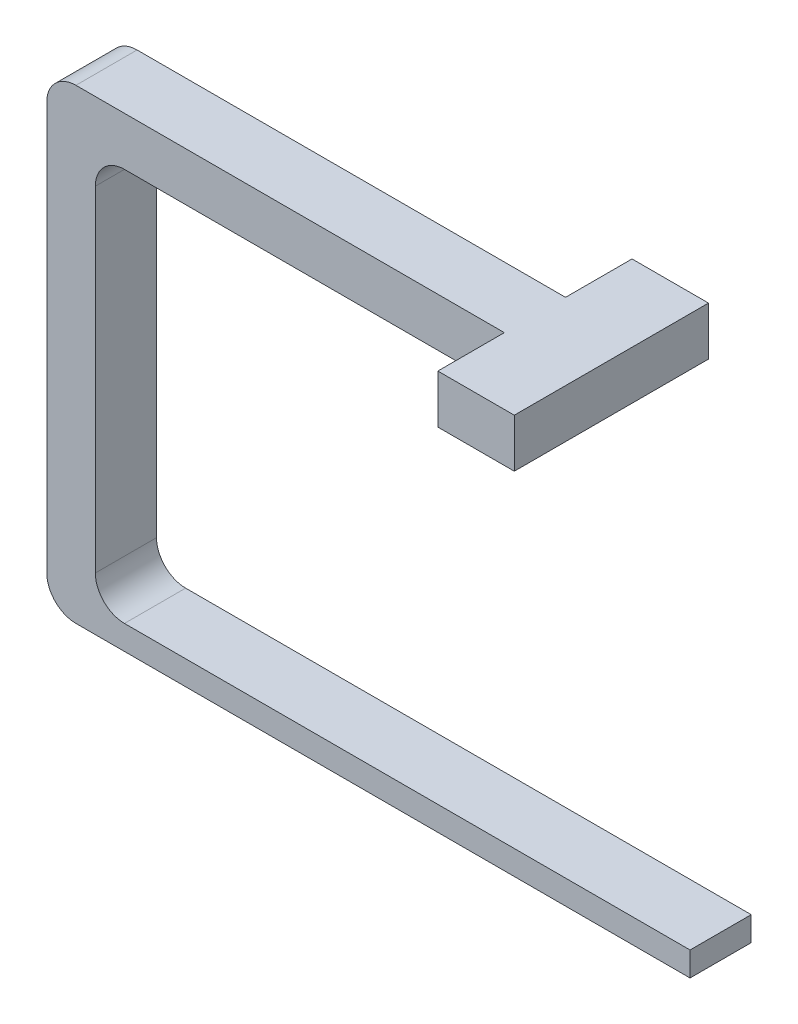
ISO-10303-21;
HEADER;
FILE_DESCRIPTION(('STEP AP214'),'2;1');
FILE_NAME('part.step','',(''),(''),'','','');
FILE_SCHEMA(('AUTOMOTIVE_DESIGN { 1 0 10303 214 1 1 1 1 }'));
ENDSEC;
DATA;
#1=APPLICATION_CONTEXT('core data for automotive mechanical design processes');
#2=APPLICATION_PROTOCOL_DEFINITION('international standard','automotive_design',2000,#1);
#3=PRODUCT_CONTEXT('',#1,'mechanical');
#4=PRODUCT('Part','Part','',(#3));
#5=PRODUCT_RELATED_PRODUCT_CATEGORY('part','',(#4));
#6=PRODUCT_DEFINITION_FORMATION('','',#4);
#7=PRODUCT_DEFINITION_CONTEXT('part definition',#1,'design');
#8=PRODUCT_DEFINITION('design','',#6,#7);
#9=PRODUCT_DEFINITION_SHAPE('','',#8);
#10=(LENGTH_UNIT() NAMED_UNIT(*) SI_UNIT(.MILLI.,.METRE.));
#11=(NAMED_UNIT(*) PLANE_ANGLE_UNIT() SI_UNIT($,.RADIAN.));
#12=(NAMED_UNIT(*) SI_UNIT($,.STERADIAN.) SOLID_ANGLE_UNIT());
#13=UNCERTAINTY_MEASURE_WITH_UNIT(LENGTH_MEASURE(1.E-05),#10,'distance_accuracy_value','');
#14=(GEOMETRIC_REPRESENTATION_CONTEXT(3) GLOBAL_UNCERTAINTY_ASSIGNED_CONTEXT((#13)) GLOBAL_UNIT_ASSIGNED_CONTEXT((#10,
#11,#12)) REPRESENTATION_CONTEXT('',''));
#15=CARTESIAN_POINT('',(0.,0.,0.));
#16=DIRECTION('',(0.,0.,1.));
#17=DIRECTION('',(1.,0.,0.));
#18=AXIS2_PLACEMENT_3D('',#15,#16,#17);
#19=CARTESIAN_POINT('',(-28.575,115.57,8.001));
#20=DIRECTION('',(-1.,0.,0.));
#21=DIRECTION('',(0.,0.,1.));
#22=AXIS2_PLACEMENT_3D('',#19,#20,#21);
#23=PLANE('',#22);
#24=DIRECTION('',(0.,0.,-1.));
#25=VECTOR('',#24,1.);
#26=CARTESIAN_POINT('',(-28.575,102.87,8.001));
#27=LINE('',#26,#25);
#28=CARTESIAN_POINT('',(-28.575,102.87,25.4));
#29=VERTEX_POINT('',#28);
#30=CARTESIAN_POINT('',(-28.575,102.87,-25.4));
#31=VERTEX_POINT('',#30);
#32=EDGE_CURVE('E209',#29,#31,#27,.T.);
#33=ORIENTED_EDGE('',*,*,#32,.T.);
#34=DIRECTION('',(0.,-1.,0.));
#35=VECTOR('',#34,1.);
#36=CARTESIAN_POINT('',(-28.575,170.165237887567,-25.4));
#37=LINE('',#36,#35);
#38=CARTESIAN_POINT('',(-28.575,115.57,-25.4));
#39=VERTEX_POINT('',#38);
#40=EDGE_CURVE('E168',#39,#31,#37,.T.);
#41=ORIENTED_EDGE('',*,*,#40,.F.);
#42=DIRECTION('',(0.,0.,-1.));
#43=VECTOR('',#42,1.);
#44=CARTESIAN_POINT('',(-28.575,115.57,8.001));
#45=LINE('',#44,#43);
#46=CARTESIAN_POINT('',(-28.575,115.57,25.4));
#47=VERTEX_POINT('',#46);
#48=EDGE_CURVE('E232',#47,#39,#45,.T.);
#49=ORIENTED_EDGE('',*,*,#48,.F.);
#50=DIRECTION('',(0.,-1.,0.));
#51=VECTOR('',#50,1.);
#52=CARTESIAN_POINT('',(-28.575,170.165237887567,25.4));
#53=LINE('',#52,#51);
#54=EDGE_CURVE('E183',#47,#29,#53,.T.);
#55=ORIENTED_EDGE('',*,*,#54,.T.);
#56=EDGE_LOOP('',(#33,#41,#49,#55));
#57=FACE_BOUND('',#56,.T.);
#58=ADVANCED_FACE('F33',(#57),#23,.F.);
#59=CARTESIAN_POINT('',(-28.575,115.57,8.001));
#60=DIRECTION('',(0.,-1.,0.));
#61=DIRECTION('',(1.,0.,0.));
#62=AXIS2_PLACEMENT_3D('',#59,#60,#61);
#63=PLANE('',#62);
#64=DIRECTION('',(-1.,0.,0.));
#65=VECTOR('',#64,1.);
#66=CARTESIAN_POINT('',(-28.575,115.57,-8.001));
#67=LINE('',#66,#65);
#68=CARTESIAN_POINT('',(-48.575,115.57,-8.001));
#69=VERTEX_POINT('',#68);
#70=CARTESIAN_POINT('',(-160.655,115.57,-8.001));
#71=VERTEX_POINT('',#70);
#72=EDGE_CURVE('E192',#69,#71,#67,.T.);
#73=ORIENTED_EDGE('',*,*,#72,.T.);
#74=DIRECTION('',(0.,0.,-1.));
#75=VECTOR('',#74,1.);
#76=CARTESIAN_POINT('',(-160.655,115.57,8.001));
#77=LINE('',#76,#75);
#78=CARTESIAN_POINT('',(-160.655,115.57,8.001));
#79=VERTEX_POINT('',#78);
#80=EDGE_CURVE('E260',#71,#79,#77,.F.);
#81=ORIENTED_EDGE('',*,*,#80,.T.);
#82=DIRECTION('',(-1.,0.,0.));
#83=VECTOR('',#82,1.);
#84=CARTESIAN_POINT('',(-28.575,115.57,8.001));
#85=LINE('',#84,#83);
#86=CARTESIAN_POINT('',(-48.575,115.57,8.001));
#87=VERTEX_POINT('',#86);
#88=EDGE_CURVE('E193',#87,#79,#85,.T.);
#89=ORIENTED_EDGE('',*,*,#88,.F.);
#90=DIRECTION('',(0.,0.,1.));
#91=VECTOR('',#90,1.);
#92=CARTESIAN_POINT('',(-48.575,115.57,-25.4));
#93=LINE('',#92,#91);
#94=CARTESIAN_POINT('',(-48.575,115.57,25.4));
#95=VERTEX_POINT('',#94);
#96=EDGE_CURVE('E282',#87,#95,#93,.T.);
#97=ORIENTED_EDGE('',*,*,#96,.T.);
#98=DIRECTION('',(1.,0.,0.));
#99=VECTOR('',#98,1.);
#100=CARTESIAN_POINT('',(-48.575,115.57,25.4));
#101=LINE('',#100,#99);
#102=EDGE_CURVE('E182',#95,#47,#101,.T.);
#103=ORIENTED_EDGE('',*,*,#102,.T.);
#104=ORIENTED_EDGE('',*,*,#48,.T.);
#105=DIRECTION('',(-1.,0.,0.));
#106=VECTOR('',#105,1.);
#107=CARTESIAN_POINT('',(-48.575,115.57,-25.4));
#108=LINE('',#107,#106);
#109=CARTESIAN_POINT('',(-48.575,115.57,-25.4));
#110=VERTEX_POINT('',#109);
#111=EDGE_CURVE('E187',#39,#110,#108,.T.);
#112=ORIENTED_EDGE('',*,*,#111,.T.);
#113=EDGE_CURVE('E165',#110,#69,#93,.T.);
#114=ORIENTED_EDGE('',*,*,#113,.T.);
#115=EDGE_LOOP('',(#73,#81,#89,#97,#103,#104,#112,#114));
#116=FACE_BOUND('',#115,.T.);
#117=ADVANCED_FACE('F323',(#116),#63,.F.);
#118=CARTESIAN_POINT('',(-168.275,0.,8.001));
#119=DIRECTION('',(1.,0.,0.));
#120=DIRECTION('',(0.,0.,-1.));
#121=AXIS2_PLACEMENT_3D('',#118,#119,#120);
#122=PLANE('',#121);
#123=DIRECTION('',(0.,-1.,0.));
#124=VECTOR('',#123,1.);
#125=CARTESIAN_POINT('',(-168.275,0.,-8.001));
#126=LINE('',#125,#124);
#127=CARTESIAN_POINT('',(-168.275,107.95,-8.001));
#128=VERTEX_POINT('',#127);
#129=CARTESIAN_POINT('',(-168.275,1.27,-8.001));
#130=VERTEX_POINT('',#129);
#131=EDGE_CURVE('E212',#128,#130,#126,.T.);
#132=ORIENTED_EDGE('',*,*,#131,.T.);
#133=DIRECTION('',(0.,0.,-1.));
#134=VECTOR('',#133,1.);
#135=CARTESIAN_POINT('',(-168.275,1.27,8.001));
#136=LINE('',#135,#134);
#137=CARTESIAN_POINT('',(-168.275,1.26999999999999,8.001));
#138=VERTEX_POINT('',#137);
#139=EDGE_CURVE('E246',#130,#138,#136,.F.);
#140=ORIENTED_EDGE('',*,*,#139,.T.);
#141=DIRECTION('',(0.,-1.,0.));
#142=VECTOR('',#141,1.);
#143=CARTESIAN_POINT('',(-168.275,115.57,8.001));
#144=LINE('',#143,#142);
#145=CARTESIAN_POINT('',(-168.275,107.95,8.001));
#146=VERTEX_POINT('',#145);
#147=EDGE_CURVE('E196',#146,#138,#144,.T.);
#148=ORIENTED_EDGE('',*,*,#147,.F.);
#149=DIRECTION('',(0.,0.,-1.));
#150=VECTOR('',#149,1.);
#151=CARTESIAN_POINT('',(-168.275,107.95,8.001));
#152=LINE('',#151,#150);
#153=EDGE_CURVE('E243',#146,#128,#152,.T.);
#154=ORIENTED_EDGE('',*,*,#153,.T.);
#155=EDGE_LOOP('',(#132,#140,#148,#154));
#156=FACE_BOUND('',#155,.T.);
#157=ADVANCED_FACE('F291',(#156),#122,.F.);
#158=CARTESIAN_POINT('',(-168.275,-6.35,8.001));
#159=DIRECTION('',(0.,1.,0.));
#160=DIRECTION('',(0.,0.,1.));
#161=AXIS2_PLACEMENT_3D('',#158,#159,#160);
#162=PLANE('',#161);
#163=DIRECTION('',(1.,0.,0.));
#164=VECTOR('',#163,1.);
#165=CARTESIAN_POINT('',(-168.275,-6.35,8.001));
#166=LINE('',#165,#164);
#167=CARTESIAN_POINT('',(-160.655,-6.35,8.001));
#168=VERTEX_POINT('',#167);
#169=CARTESIAN_POINT('',(0.,-6.35,8.001));
#170=VERTEX_POINT('',#169);
#171=EDGE_CURVE('E199',#168,#170,#166,.T.);
#172=ORIENTED_EDGE('',*,*,#171,.F.);
#173=DIRECTION('',(0.,0.,-1.));
#174=VECTOR('',#173,1.);
#175=CARTESIAN_POINT('',(-160.655,-6.35,8.001));
#176=LINE('',#175,#174);
#177=CARTESIAN_POINT('',(-160.655,-6.35,-8.001));
#178=VERTEX_POINT('',#177);
#179=EDGE_CURVE('E236',#168,#178,#176,.T.);
#180=ORIENTED_EDGE('',*,*,#179,.T.);
#181=DIRECTION('',(1.,0.,0.));
#182=VECTOR('',#181,1.);
#183=CARTESIAN_POINT('',(-168.275,-6.35,-8.001));
#184=LINE('',#183,#182);
#185=CARTESIAN_POINT('',(0.,-6.35,-8.001));
#186=VERTEX_POINT('',#185);
#187=EDGE_CURVE('E215',#178,#186,#184,.T.);
#188=ORIENTED_EDGE('',*,*,#187,.T.);
#189=DIRECTION('',(0.,0.,-1.));
#190=VECTOR('',#189,1.);
#191=CARTESIAN_POINT('',(0.,-6.35,8.001));
#192=LINE('',#191,#190);
#193=EDGE_CURVE('E229',#170,#186,#192,.T.);
#194=ORIENTED_EDGE('',*,*,#193,.F.);
#195=EDGE_LOOP('',(#172,#180,#188,#194));
#196=FACE_BOUND('',#195,.T.);
#197=ADVANCED_FACE('F301',(#196),#162,.F.);
#198=CARTESIAN_POINT('',(0.,0.,8.001));
#199=DIRECTION('',(-1.,0.,0.));
#200=DIRECTION('',(0.,0.,1.));
#201=AXIS2_PLACEMENT_3D('',#198,#199,#200);
#202=PLANE('',#201);
#203=DIRECTION('',(0.,1.,0.));
#204=VECTOR('',#203,1.);
#205=CARTESIAN_POINT('',(0.,0.,-8.001));
#206=LINE('',#205,#204);
#207=CARTESIAN_POINT('',(0.,0.,-8.001));
#208=VERTEX_POINT('',#207);
#209=EDGE_CURVE('E217',#186,#208,#206,.T.);
#210=ORIENTED_EDGE('',*,*,#209,.T.);
#211=DIRECTION('',(0.,0.,-1.));
#212=VECTOR('',#211,1.);
#213=CARTESIAN_POINT('',(0.,0.,8.001));
#214=LINE('',#213,#212);
#215=CARTESIAN_POINT('',(0.,0.,8.001));
#216=VERTEX_POINT('',#215);
#217=EDGE_CURVE('E226',#216,#208,#214,.T.);
#218=ORIENTED_EDGE('',*,*,#217,.F.);
#219=DIRECTION('',(0.,1.,0.));
#220=VECTOR('',#219,1.);
#221=CARTESIAN_POINT('',(0.,0.,8.001));
#222=LINE('',#221,#220);
#223=EDGE_CURVE('E201',#170,#216,#222,.T.);
#224=ORIENTED_EDGE('',*,*,#223,.F.);
#225=ORIENTED_EDGE('',*,*,#193,.T.);
#226=EDGE_LOOP('',(#210,#218,#224,#225));
#227=FACE_BOUND('',#226,.T.);
#228=ADVANCED_FACE('F307',(#227),#202,.F.);
#229=CARTESIAN_POINT('',(-155.575,0.,8.001));
#230=DIRECTION('',(0.,-1.,0.));
#231=DIRECTION('',(0.,0.,-1.));
#232=AXIS2_PLACEMENT_3D('',#229,#230,#231);
#233=PLANE('',#232);
#234=DIRECTION('',(-1.,0.,0.));
#235=VECTOR('',#234,1.);
#236=CARTESIAN_POINT('',(-155.575,0.,-8.001));
#237=LINE('',#236,#235);
#238=CARTESIAN_POINT('',(-147.955,0.,-8.001));
#239=VERTEX_POINT('',#238);
#240=EDGE_CURVE('E219',#208,#239,#237,.T.);
#241=ORIENTED_EDGE('',*,*,#240,.T.);
#242=DIRECTION('',(0.,0.,-1.));
#243=VECTOR('',#242,1.);
#244=CARTESIAN_POINT('',(-147.955,0.,8.001));
#245=LINE('',#244,#243);
#246=CARTESIAN_POINT('',(-147.955,0.,8.001));
#247=VERTEX_POINT('',#246);
#248=EDGE_CURVE('E256',#239,#247,#245,.F.);
#249=ORIENTED_EDGE('',*,*,#248,.T.);
#250=DIRECTION('',(-1.,0.,0.));
#251=VECTOR('',#250,1.);
#252=CARTESIAN_POINT('',(-155.575,0.,8.001));
#253=LINE('',#252,#251);
#254=EDGE_CURVE('E203',#216,#247,#253,.T.);
#255=ORIENTED_EDGE('',*,*,#254,.F.);
#256=ORIENTED_EDGE('',*,*,#217,.T.);
#257=EDGE_LOOP('',(#241,#249,#255,#256));
#258=FACE_BOUND('',#257,.T.);
#259=ADVANCED_FACE('F310',(#258),#233,.F.);
#260=CARTESIAN_POINT('',(-155.575,102.87,8.001));
#261=DIRECTION('',(-1.,0.,0.));
#262=DIRECTION('',(0.,0.,1.));
#263=AXIS2_PLACEMENT_3D('',#260,#261,#262);
#264=PLANE('',#263);
#265=DIRECTION('',(0.,1.,0.));
#266=VECTOR('',#265,1.);
#267=CARTESIAN_POINT('',(-155.575,102.87,8.001));
#268=LINE('',#267,#266);
#269=CARTESIAN_POINT('',(-155.575,7.62000000000003,8.001));
#270=VERTEX_POINT('',#269);
#271=CARTESIAN_POINT('',(-155.575,95.25,8.001));
#272=VERTEX_POINT('',#271);
#273=EDGE_CURVE('E205',#270,#272,#268,.T.);
#274=ORIENTED_EDGE('',*,*,#273,.F.);
#275=DIRECTION('',(0.,0.,-1.));
#276=VECTOR('',#275,1.);
#277=CARTESIAN_POINT('',(-155.575,7.62,-8.001));
#278=LINE('',#277,#276);
#279=CARTESIAN_POINT('',(-155.575,7.62000000000003,-8.001));
#280=VERTEX_POINT('',#279);
#281=EDGE_CURVE('E253',#270,#280,#278,.T.);
#282=ORIENTED_EDGE('',*,*,#281,.T.);
#283=DIRECTION('',(0.,1.,0.));
#284=VECTOR('',#283,1.);
#285=CARTESIAN_POINT('',(-155.575,102.87,-8.001));
#286=LINE('',#285,#284);
#287=CARTESIAN_POINT('',(-155.575,95.25,-8.001));
#288=VERTEX_POINT('',#287);
#289=EDGE_CURVE('E222',#280,#288,#286,.T.);
#290=ORIENTED_EDGE('',*,*,#289,.T.);
#291=DIRECTION('',(0.,0.,-1.));
#292=VECTOR('',#291,1.);
#293=CARTESIAN_POINT('',(-155.575,95.25,8.001));
#294=LINE('',#293,#292);
#295=EDGE_CURVE('E48',#288,#272,#294,.F.);
#296=ORIENTED_EDGE('',*,*,#295,.T.);
#297=EDGE_LOOP('',(#274,#282,#290,#296));
#298=FACE_BOUND('',#297,.T.);
#299=ADVANCED_FACE('F270',(#298),#264,.F.);
#300=CARTESIAN_POINT('',(-28.575,102.87,8.001));
#301=DIRECTION('',(0.,1.,0.));
#302=DIRECTION('',(-1.,0.,0.));
#303=AXIS2_PLACEMENT_3D('',#300,#301,#302);
#304=PLANE('',#303);
#305=DIRECTION('',(1.,0.,0.));
#306=VECTOR('',#305,1.);
#307=CARTESIAN_POINT('',(-28.575,102.87,8.001));
#308=LINE('',#307,#306);
#309=CARTESIAN_POINT('',(-147.955,102.87,8.001));
#310=VERTEX_POINT('',#309);
#311=CARTESIAN_POINT('',(-48.575,102.87,8.001));
#312=VERTEX_POINT('',#311);
#313=EDGE_CURVE('E207',#310,#312,#308,.T.);
#314=ORIENTED_EDGE('',*,*,#313,.F.);
#315=DIRECTION('',(0.,0.,-1.));
#316=VECTOR('',#315,1.);
#317=CARTESIAN_POINT('',(-147.955,102.87,-8.001));
#318=LINE('',#317,#316);
#319=CARTESIAN_POINT('',(-147.955,102.87,-8.001));
#320=VERTEX_POINT('',#319);
#321=EDGE_CURVE('E258',#310,#320,#318,.T.);
#322=ORIENTED_EDGE('',*,*,#321,.T.);
#323=DIRECTION('',(1.,0.,0.));
#324=VECTOR('',#323,1.);
#325=CARTESIAN_POINT('',(-28.575,102.87,-8.001));
#326=LINE('',#325,#324);
#327=CARTESIAN_POINT('',(-48.575,102.87,-8.001));
#328=VERTEX_POINT('',#327);
#329=EDGE_CURVE('E155',#320,#328,#326,.T.);
#330=ORIENTED_EDGE('',*,*,#329,.T.);
#331=DIRECTION('',(0.,0.,-1.));
#332=VECTOR('',#331,1.);
#333=CARTESIAN_POINT('',(-48.575,102.87,-25.4));
#334=LINE('',#333,#332);
#335=CARTESIAN_POINT('',(-48.575,102.87,-25.4));
#336=VERTEX_POINT('',#335);
#337=EDGE_CURVE('E147',#328,#336,#334,.T.);
#338=ORIENTED_EDGE('',*,*,#337,.T.);
#339=DIRECTION('',(1.,0.,0.));
#340=VECTOR('',#339,1.);
#341=CARTESIAN_POINT('',(-48.575,102.87,-25.4));
#342=LINE('',#341,#340);
#343=EDGE_CURVE('E152',#336,#31,#342,.T.);
#344=ORIENTED_EDGE('',*,*,#343,.T.);
#345=ORIENTED_EDGE('',*,*,#32,.F.);
#346=DIRECTION('',(-1.,0.,0.));
#347=VECTOR('',#346,1.);
#348=CARTESIAN_POINT('',(-48.575,102.87,25.4));
#349=LINE('',#348,#347);
#350=CARTESIAN_POINT('',(-48.575,102.87,25.4));
#351=VERTEX_POINT('',#350);
#352=EDGE_CURVE('E169',#29,#351,#349,.T.);
#353=ORIENTED_EDGE('',*,*,#352,.T.);
#354=EDGE_CURVE('E159',#351,#312,#334,.T.);
#355=ORIENTED_EDGE('',*,*,#354,.T.);
#356=EDGE_LOOP('',(#314,#322,#330,#338,#344,#345,#353,#355));
#357=FACE_BOUND('',#356,.T.);
#358=ADVANCED_FACE('F150',(#357),#304,.F.);
#359=CARTESIAN_POINT('',(0.,0.,8.001));
#360=DIRECTION('',(0.,0.,-1.));
#361=DIRECTION('',(-1.,0.,0.));
#362=AXIS2_PLACEMENT_3D('',#359,#360,#361);
#363=PLANE('',#362);
#364=ORIENTED_EDGE('',*,*,#147,.T.);
#365=CARTESIAN_POINT('',(-160.655,1.27,8.001));
#366=DIRECTION('',(0.,0.,-1.));
#367=DIRECTION('',(-1.,0.,0.));
#368=AXIS2_PLACEMENT_3D('',#365,#366,#367);
#369=CIRCLE('',#368,7.62);
#370=EDGE_CURVE('E250',#138,#168,#369,.F.);
#371=ORIENTED_EDGE('',*,*,#370,.T.);
#372=ORIENTED_EDGE('',*,*,#171,.T.);
#373=ORIENTED_EDGE('',*,*,#223,.T.);
#374=ORIENTED_EDGE('',*,*,#254,.T.);
#375=CARTESIAN_POINT('',(-147.955,7.62,8.001));
#376=DIRECTION('',(0.,0.,-1.));
#377=DIRECTION('',(-1.,0.,0.));
#378=AXIS2_PLACEMENT_3D('',#375,#376,#377);
#379=CIRCLE('',#378,7.62);
#380=EDGE_CURVE('E55',#247,#270,#379,.T.);
#381=ORIENTED_EDGE('',*,*,#380,.T.);
#382=ORIENTED_EDGE('',*,*,#273,.T.);
#383=CARTESIAN_POINT('',(-147.955,95.25,8.001));
#384=DIRECTION('',(0.,0.,-1.));
#385=DIRECTION('',(-1.,0.,0.));
#386=AXIS2_PLACEMENT_3D('',#383,#384,#385);
#387=CIRCLE('',#386,7.62);
#388=EDGE_CURVE('E11',#272,#310,#387,.T.);
#389=ORIENTED_EDGE('',*,*,#388,.T.);
#390=ORIENTED_EDGE('',*,*,#313,.T.);
#391=DIRECTION('',(0.,1.,0.));
#392=VECTOR('',#391,1.);
#393=CARTESIAN_POINT('',(-48.575,0.,8.001));
#394=LINE('',#393,#392);
#395=EDGE_CURVE('E189',#312,#87,#394,.T.);
#396=ORIENTED_EDGE('',*,*,#395,.T.);
#397=ORIENTED_EDGE('',*,*,#88,.T.);
#398=CARTESIAN_POINT('',(-160.655,107.95,8.001));
#399=DIRECTION('',(0.,0.,-1.));
#400=DIRECTION('',(-1.,0.,0.));
#401=AXIS2_PLACEMENT_3D('',#398,#399,#400);
#402=CIRCLE('',#401,7.62);
#403=EDGE_CURVE('E248',#79,#146,#402,.F.);
#404=ORIENTED_EDGE('',*,*,#403,.T.);
#405=EDGE_LOOP('',(#364,#371,#372,#373,#374,#381,#382,#389,#390,#396,#397,#404));
#406=FACE_BOUND('',#405,.T.);
#407=ADVANCED_FACE('F274',(#406),#363,.F.);
#408=CARTESIAN_POINT('',(0.,0.,-8.001));
#409=DIRECTION('',(0.,0.,-1.));
#410=DIRECTION('',(-1.,0.,0.));
#411=AXIS2_PLACEMENT_3D('',#408,#409,#410);
#412=PLANE('',#411);
#413=ORIENTED_EDGE('',*,*,#187,.F.);
#414=CARTESIAN_POINT('',(-160.655,1.27,-8.001));
#415=DIRECTION('',(0.,0.,-1.));
#416=DIRECTION('',(-1.,0.,0.));
#417=AXIS2_PLACEMENT_3D('',#414,#415,#416);
#418=CIRCLE('',#417,7.62);
#419=EDGE_CURVE('E241',#178,#130,#418,.T.);
#420=ORIENTED_EDGE('',*,*,#419,.T.);
#421=ORIENTED_EDGE('',*,*,#131,.F.);
#422=CARTESIAN_POINT('',(-160.655,107.95,-8.001));
#423=DIRECTION('',(0.,0.,-1.));
#424=DIRECTION('',(-1.,0.,0.));
#425=AXIS2_PLACEMENT_3D('',#422,#423,#424);
#426=CIRCLE('',#425,7.62);
#427=EDGE_CURVE('E239',#128,#71,#426,.T.);
#428=ORIENTED_EDGE('',*,*,#427,.T.);
#429=ORIENTED_EDGE('',*,*,#72,.F.);
#430=DIRECTION('',(0.,1.,0.));
#431=VECTOR('',#430,1.);
#432=CARTESIAN_POINT('',(-48.575,0.,-8.001));
#433=LINE('',#432,#431);
#434=EDGE_CURVE('E234',#328,#69,#433,.T.);
#435=ORIENTED_EDGE('',*,*,#434,.F.);
#436=ORIENTED_EDGE('',*,*,#329,.F.);
#437=CARTESIAN_POINT('',(-147.955,95.25,-8.001));
#438=DIRECTION('',(0.,0.,-1.));
#439=DIRECTION('',(-1.,0.,0.));
#440=AXIS2_PLACEMENT_3D('',#437,#438,#439);
#441=CIRCLE('',#440,7.62);
#442=EDGE_CURVE('E41',#320,#288,#441,.F.);
#443=ORIENTED_EDGE('',*,*,#442,.T.);
#444=ORIENTED_EDGE('',*,*,#289,.F.);
#445=CARTESIAN_POINT('',(-147.955,7.62,-8.001));
#446=DIRECTION('',(0.,0.,-1.));
#447=DIRECTION('',(-1.,0.,0.));
#448=AXIS2_PLACEMENT_3D('',#445,#446,#447);
#449=CIRCLE('',#448,7.62);
#450=EDGE_CURVE('E262',#280,#239,#449,.F.);
#451=ORIENTED_EDGE('',*,*,#450,.T.);
#452=ORIENTED_EDGE('',*,*,#240,.F.);
#453=ORIENTED_EDGE('',*,*,#209,.F.);
#454=EDGE_LOOP('',(#413,#420,#421,#428,#429,#435,#436,#443,#444,#451,#452,#453));
#455=FACE_BOUND('',#454,.T.);
#456=ADVANCED_FACE('F267',(#455),#412,.T.);
#457=CARTESIAN_POINT('',(-48.575,170.165237887567,-25.4));
#458=DIRECTION('',(0.,0.,-1.));
#459=DIRECTION('',(-1.,0.,0.));
#460=AXIS2_PLACEMENT_3D('',#457,#458,#459);
#461=PLANE('',#460);
#462=ORIENTED_EDGE('',*,*,#111,.F.);
#463=ORIENTED_EDGE('',*,*,#40,.T.);
#464=ORIENTED_EDGE('',*,*,#343,.F.);
#465=DIRECTION('',(0.,-1.,0.));
#466=VECTOR('',#465,1.);
#467=CARTESIAN_POINT('',(-48.575,170.165237887567,-25.4));
#468=LINE('',#467,#466);
#469=EDGE_CURVE('E163',#110,#336,#468,.T.);
#470=ORIENTED_EDGE('',*,*,#469,.F.);
#471=EDGE_LOOP('',(#462,#463,#464,#470));
#472=FACE_BOUND('',#471,.T.);
#473=ADVANCED_FACE('F172',(#472),#461,.T.);
#474=CARTESIAN_POINT('',(-48.575,170.165237887567,-25.4));
#475=DIRECTION('',(-1.,0.,0.));
#476=DIRECTION('',(0.,-1.,0.));
#477=AXIS2_PLACEMENT_3D('',#474,#475,#476);
#478=PLANE('',#477);
#479=ORIENTED_EDGE('',*,*,#337,.F.);
#480=ORIENTED_EDGE('',*,*,#434,.T.);
#481=ORIENTED_EDGE('',*,*,#113,.F.);
#482=ORIENTED_EDGE('',*,*,#469,.T.);
#483=EDGE_LOOP('',(#479,#480,#481,#482));
#484=FACE_BOUND('',#483,.T.);
#485=ADVANCED_FACE('F164',(#484),#478,.T.);
#486=ORIENTED_EDGE('',*,*,#395,.F.);
#487=ORIENTED_EDGE('',*,*,#354,.F.);
#488=DIRECTION('',(0.,-1.,0.));
#489=VECTOR('',#488,1.);
#490=CARTESIAN_POINT('',(-48.575,170.165237887567,25.4));
#491=LINE('',#490,#489);
#492=EDGE_CURVE('E180',#95,#351,#491,.T.);
#493=ORIENTED_EDGE('',*,*,#492,.F.);
#494=ORIENTED_EDGE('',*,*,#96,.F.);
#495=EDGE_LOOP('',(#486,#487,#493,#494));
#496=FACE_BOUND('',#495,.T.);
#497=ADVANCED_FACE('F280',(#496),#478,.T.);
#498=CARTESIAN_POINT('',(-48.575,170.165237887567,25.4));
#499=DIRECTION('',(0.,0.,1.));
#500=DIRECTION('',(1.,0.,0.));
#501=AXIS2_PLACEMENT_3D('',#498,#499,#500);
#502=PLANE('',#501);
#503=ORIENTED_EDGE('',*,*,#102,.F.);
#504=ORIENTED_EDGE('',*,*,#492,.T.);
#505=ORIENTED_EDGE('',*,*,#352,.F.);
#506=ORIENTED_EDGE('',*,*,#54,.F.);
#507=EDGE_LOOP('',(#503,#504,#505,#506));
#508=FACE_BOUND('',#507,.T.);
#509=ADVANCED_FACE('F320',(#508),#502,.T.);
#510=CARTESIAN_POINT('',(-160.655,1.27,8.001));
#511=DIRECTION('',(0.,0.,-1.));
#512=DIRECTION('',(-1.,0.,0.));
#513=AXIS2_PLACEMENT_3D('',#510,#511,#512);
#514=CYLINDRICAL_SURFACE('',#513,7.62);
#515=ORIENTED_EDGE('',*,*,#370,.F.);
#516=ORIENTED_EDGE('',*,*,#139,.F.);
#517=ORIENTED_EDGE('',*,*,#419,.F.);
#518=ORIENTED_EDGE('',*,*,#179,.F.);
#519=EDGE_LOOP('',(#515,#516,#517,#518));
#520=FACE_BOUND('',#519,.T.);
#521=ADVANCED_FACE('F298',(#520),#514,.T.);
#522=CARTESIAN_POINT('',(-147.955,7.62,8.001));
#523=DIRECTION('',(0.,0.,1.));
#524=DIRECTION('',(1.,0.,0.));
#525=AXIS2_PLACEMENT_3D('',#522,#523,#524);
#526=CYLINDRICAL_SURFACE('',#525,7.62);
#527=ORIENTED_EDGE('',*,*,#380,.F.);
#528=ORIENTED_EDGE('',*,*,#248,.F.);
#529=ORIENTED_EDGE('',*,*,#450,.F.);
#530=ORIENTED_EDGE('',*,*,#281,.F.);
#531=EDGE_LOOP('',(#527,#528,#529,#530));
#532=FACE_BOUND('',#531,.T.);
#533=ADVANCED_FACE('F313',(#532),#526,.F.);
#534=CARTESIAN_POINT('',(-147.955,95.25,8.001));
#535=DIRECTION('',(0.,0.,1.));
#536=DIRECTION('',(1.,0.,0.));
#537=AXIS2_PLACEMENT_3D('',#534,#535,#536);
#538=CYLINDRICAL_SURFACE('',#537,7.62);
#539=ORIENTED_EDGE('',*,*,#388,.F.);
#540=ORIENTED_EDGE('',*,*,#295,.F.);
#541=ORIENTED_EDGE('',*,*,#442,.F.);
#542=ORIENTED_EDGE('',*,*,#321,.F.);
#543=EDGE_LOOP('',(#539,#540,#541,#542));
#544=FACE_BOUND('',#543,.T.);
#545=ADVANCED_FACE('F273',(#544),#538,.F.);
#546=CARTESIAN_POINT('',(-160.655,107.95,8.001));
#547=DIRECTION('',(0.,0.,-1.));
#548=DIRECTION('',(-1.,0.,0.));
#549=AXIS2_PLACEMENT_3D('',#546,#547,#548);
#550=CYLINDRICAL_SURFACE('',#549,7.62);
#551=ORIENTED_EDGE('',*,*,#403,.F.);
#552=ORIENTED_EDGE('',*,*,#80,.F.);
#553=ORIENTED_EDGE('',*,*,#427,.F.);
#554=ORIENTED_EDGE('',*,*,#153,.F.);
#555=EDGE_LOOP('',(#551,#552,#553,#554));
#556=FACE_BOUND('',#555,.T.);
#557=ADVANCED_FACE('F35',(#556),#550,.T.);
#558=CLOSED_SHELL('',(#58,#117,#157,#197,#228,#259,#299,#358,#407,#456,#473,#485,#497,#509,#521,
#533,#545,#557));
#559=MANIFOLD_SOLID_BREP('B2',#558);
#560=ADVANCED_BREP_SHAPE_REPRESENTATION('',(#18,#559),#14);
#561=SHAPE_DEFINITION_REPRESENTATION(#9,#560);
ENDSEC;
END-ISO-10303-21;
